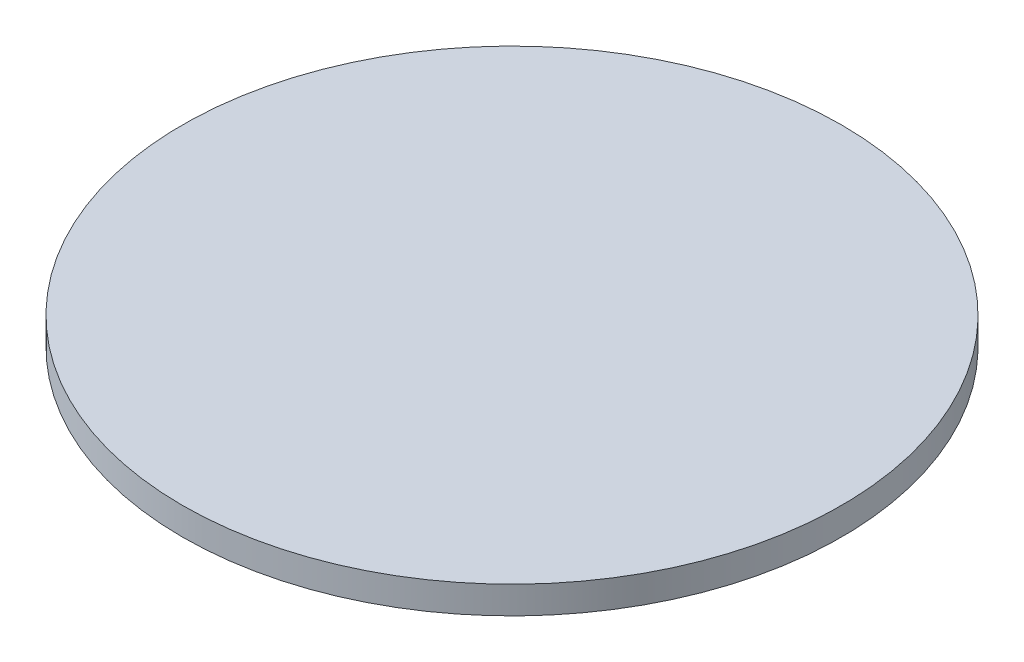
ISO-10303-21;
HEADER;
FILE_DESCRIPTION(('STEP AP214'),'2;1');
FILE_NAME('part.step','',(''),(''),'','','');
FILE_SCHEMA(('AUTOMOTIVE_DESIGN { 1 0 10303 214 1 1 1 1 }'));
ENDSEC;
DATA;
#1=APPLICATION_CONTEXT('core data for automotive mechanical design processes');
#2=APPLICATION_PROTOCOL_DEFINITION('international standard','automotive_design',2000,#1);
#3=PRODUCT_CONTEXT('',#1,'mechanical');
#4=PRODUCT('Part','Part','',(#3));
#5=PRODUCT_RELATED_PRODUCT_CATEGORY('part','',(#4));
#6=PRODUCT_DEFINITION_FORMATION('','',#4);
#7=PRODUCT_DEFINITION_CONTEXT('part definition',#1,'design');
#8=PRODUCT_DEFINITION('design','',#6,#7);
#9=PRODUCT_DEFINITION_SHAPE('','',#8);
#10=(LENGTH_UNIT() NAMED_UNIT(*) SI_UNIT(.MILLI.,.METRE.));
#11=(NAMED_UNIT(*) PLANE_ANGLE_UNIT() SI_UNIT($,.RADIAN.));
#12=(NAMED_UNIT(*) SI_UNIT($,.STERADIAN.) SOLID_ANGLE_UNIT());
#13=UNCERTAINTY_MEASURE_WITH_UNIT(LENGTH_MEASURE(1.E-05),#10,'distance_accuracy_value','');
#14=(GEOMETRIC_REPRESENTATION_CONTEXT(3) GLOBAL_UNCERTAINTY_ASSIGNED_CONTEXT((#13)) GLOBAL_UNIT_ASSIGNED_CONTEXT((#10,
#11,#12)) REPRESENTATION_CONTEXT('',''));
#15=CARTESIAN_POINT('',(0.,0.,0.));
#16=DIRECTION('',(0.,0.,1.));
#17=DIRECTION('',(1.,0.,0.));
#18=AXIS2_PLACEMENT_3D('',#15,#16,#17);
#19=CARTESIAN_POINT('',(0.,3.,0.));
#20=DIRECTION('',(0.,-1.,0.));
#21=DIRECTION('',(0.,0.,-1.));
#22=AXIS2_PLACEMENT_3D('',#19,#20,#21);
#23=PLANE('',#22);
#24=CARTESIAN_POINT('',(0.,3.,0.));
#25=DIRECTION('',(0.,-1.,0.));
#26=DIRECTION('',(0.,0.,-1.));
#27=AXIS2_PLACEMENT_3D('',#24,#25,#26);
#28=CIRCLE('',#27,72.577794898144);
#29=CARTESIAN_POINT('',(0.,3.,-72.577794898144));
#30=VERTEX_POINT('',#29);
#31=EDGE_CURVE('E10',#30,#30,#28,.F.);
#32=ORIENTED_EDGE('',*,*,#31,.F.);
#33=EDGE_LOOP('',(#32));
#34=FACE_BOUND('',#33,.T.);
#35=ADVANCED_FACE('F39',(#34),#23,.T.);
#36=CARTESIAN_POINT('',(0.,8.,0.));
#37=DIRECTION('',(0.,-1.,0.));
#38=DIRECTION('',(0.,0.,-1.));
#39=AXIS2_PLACEMENT_3D('',#36,#37,#38);
#40=TOROIDAL_SURFACE('',#39,72.577794898144,5.);
#41=ORIENTED_EDGE('',*,*,#31,.T.);
#42=EDGE_LOOP('',(#41));
#43=FACE_BOUND('',#42,.T.);
#44=CARTESIAN_POINT('',(0.,3.83974852831079,0.));
#45=DIRECTION('',(0.,1.,0.));
#46=DIRECTION('',(0.,0.,1.));
#47=AXIS2_PLACEMENT_3D('',#44,#45,#46);
#48=CIRCLE('',#47,75.3512958792702);
#49=CARTESIAN_POINT('',(0.,3.83974852831079,75.3512958792702));
#50=VERTEX_POINT('',#49);
#51=EDGE_CURVE('E47',#50,#50,#48,.F.);
#52=ORIENTED_EDGE('',*,*,#51,.T.);
#53=EDGE_LOOP('',(#52));
#54=FACE_BOUND('',#53,.T.);
#55=ADVANCED_FACE('F90',(#43,#54),#40,.T.);
#56=CARTESIAN_POINT('',(0.,2.49615088301353,0.));
#57=DIRECTION('',(0.,1.,0.));
#58=DIRECTION('',(0.,0.,1.));
#59=AXIS2_PLACEMENT_3D('',#56,#57,#58);
#60=CONICAL_SURFACE('',#59,73.3358994113243,0.982793723247329);
#61=ORIENTED_EDGE('',*,*,#51,.F.);
#62=EDGE_LOOP('',(#61));
#63=FACE_BOUND('',#62,.T.);
#64=CARTESIAN_POINT('',(0.,14.1602514716892,0.));
#65=DIRECTION('',(0.,1.,0.));
#66=DIRECTION('',(0.,0.,1.));
#67=AXIS2_PLACEMENT_3D('',#64,#65,#66);
#68=CIRCLE('',#67,90.8320502943378);
#69=CARTESIAN_POINT('',(0.,14.1602514716892,90.8320502943378));
#70=VERTEX_POINT('',#69);
#71=EDGE_CURVE('E52',#70,#70,#68,.T.);
#72=ORIENTED_EDGE('',*,*,#71,.F.);
#73=EDGE_LOOP('',(#72));
#74=FACE_BOUND('',#73,.T.);
#75=ADVANCED_FACE('F96',(#63,#74),#60,.T.);
#76=CARTESIAN_POINT('',(0.,10.,0.));
#77=DIRECTION('',(0.,1.,0.));
#78=DIRECTION('',(0.,0.,1.));
#79=AXIS2_PLACEMENT_3D('',#76,#77,#78);
#80=TOROIDAL_SURFACE('',#79,93.605551275464,5.);
#81=ORIENTED_EDGE('',*,*,#71,.T.);
#82=EDGE_LOOP('',(#81));
#83=FACE_BOUND('',#82,.T.);
#84=CARTESIAN_POINT('',(0.,15.,0.));
#85=DIRECTION('',(0.,1.,0.));
#86=DIRECTION('',(0.,0.,1.));
#87=AXIS2_PLACEMENT_3D('',#84,#85,#86);
#88=CIRCLE('',#87,93.605551275464);
#89=CARTESIAN_POINT('',(0.,15.,93.605551275464));
#90=VERTEX_POINT('',#89);
#91=EDGE_CURVE('E57',#90,#90,#88,.F.);
#92=ORIENTED_EDGE('',*,*,#91,.T.);
#93=EDGE_LOOP('',(#92));
#94=FACE_BOUND('',#93,.T.);
#95=ADVANCED_FACE('F41',(#83,#94),#80,.F.);
#96=CARTESIAN_POINT('',(0.,25.,0.));
#97=DIRECTION('',(0.,-1.,0.));
#98=DIRECTION('',(0.,0.,-1.));
#99=AXIS2_PLACEMENT_3D('',#96,#97,#98);
#100=CYLINDRICAL_SURFACE('',#99,120.);
#101=CARTESIAN_POINT('',(0.,25.,0.));
#102=DIRECTION('',(0.,1.,0.));
#103=DIRECTION('',(0.,0.,1.));
#104=AXIS2_PLACEMENT_3D('',#101,#102,#103);
#105=CIRCLE('',#104,120.);
#106=CARTESIAN_POINT('',(0.,25.,120.));
#107=VERTEX_POINT('',#106);
#108=EDGE_CURVE('E63',#107,#107,#105,.T.);
#109=ORIENTED_EDGE('',*,*,#108,.F.);
#110=EDGE_LOOP('',(#109));
#111=FACE_BOUND('',#110,.T.);
#112=CARTESIAN_POINT('',(0.,15.,0.));
#113=DIRECTION('',(0.,1.,0.));
#114=DIRECTION('',(0.,0.,1.));
#115=AXIS2_PLACEMENT_3D('',#112,#113,#114);
#116=CIRCLE('',#115,120.);
#117=CARTESIAN_POINT('',(0.,15.,120.));
#118=VERTEX_POINT('',#117);
#119=EDGE_CURVE('E64',#118,#118,#116,.T.);
#120=ORIENTED_EDGE('',*,*,#119,.T.);
#121=EDGE_LOOP('',(#120));
#122=FACE_BOUND('',#121,.T.);
#123=ADVANCED_FACE('F74',(#111,#122),#100,.T.);
#124=CARTESIAN_POINT('',(0.,25.,0.));
#125=DIRECTION('',(0.,1.,0.));
#126=DIRECTION('',(0.,0.,1.));
#127=AXIS2_PLACEMENT_3D('',#124,#125,#126);
#128=PLANE('',#127);
#129=ORIENTED_EDGE('',*,*,#108,.T.);
#130=EDGE_LOOP('',(#129));
#131=FACE_BOUND('',#130,.T.);
#132=ADVANCED_FACE('F72',(#131),#128,.T.);
#133=CARTESIAN_POINT('',(0.,15.,0.));
#134=DIRECTION('',(0.,1.,0.));
#135=DIRECTION('',(0.,0.,1.));
#136=AXIS2_PLACEMENT_3D('',#133,#134,#135);
#137=PLANE('',#136);
#138=ORIENTED_EDGE('',*,*,#91,.F.);
#139=EDGE_LOOP('',(#138));
#140=FACE_BOUND('',#139,.T.);
#141=ORIENTED_EDGE('',*,*,#119,.F.);
#142=EDGE_LOOP('',(#141));
#143=FACE_BOUND('',#142,.T.);
#144=ADVANCED_FACE('F80',(#140,#143),#137,.F.);
#145=CLOSED_SHELL('',(#35,#55,#75,#95,#123,#132,#144));
#146=MANIFOLD_SOLID_BREP('B2',#145);
#147=ADVANCED_BREP_SHAPE_REPRESENTATION('',(#18,#146),#14);
#148=SHAPE_DEFINITION_REPRESENTATION(#9,#147);
ENDSEC;
END-ISO-10303-21;
